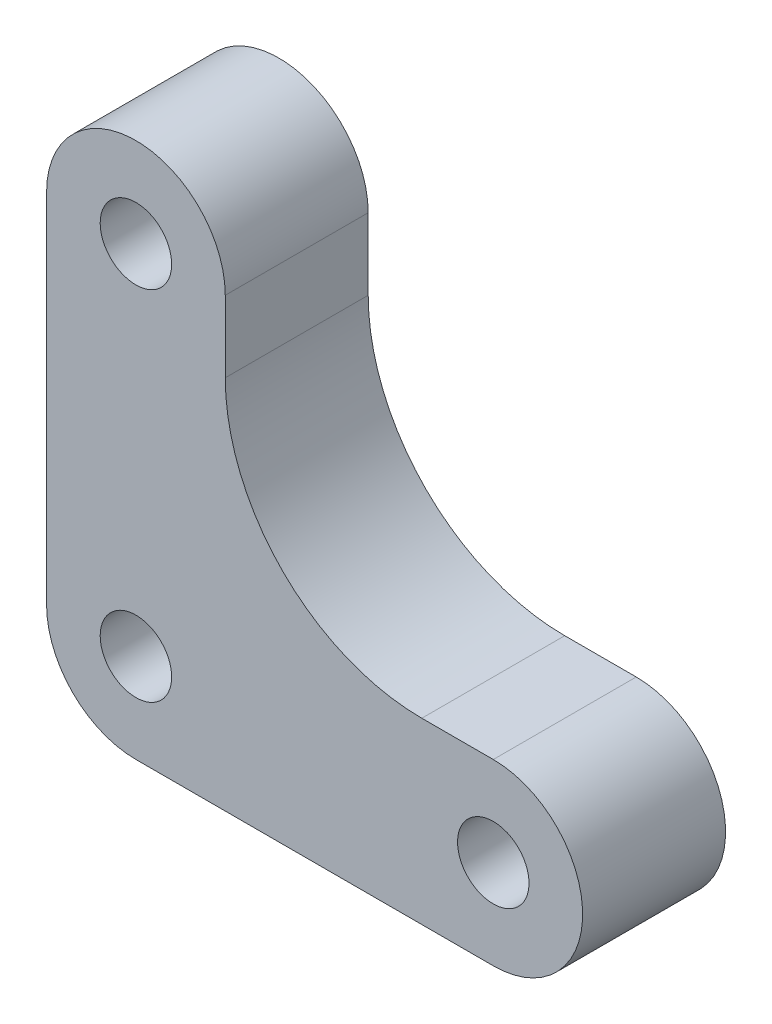
ISO-10303-21;
HEADER;
FILE_DESCRIPTION(('STEP AP214'),'2;1');
FILE_NAME('part.step','',(''),(''),'','','');
FILE_SCHEMA(('AUTOMOTIVE_DESIGN { 1 0 10303 214 1 1 1 1 }'));
ENDSEC;
DATA;
#1=APPLICATION_CONTEXT('core data for automotive mechanical design processes');
#2=APPLICATION_PROTOCOL_DEFINITION('international standard','automotive_design',2000,#1);
#3=PRODUCT_CONTEXT('',#1,'mechanical');
#4=PRODUCT('Part','Part','',(#3));
#5=PRODUCT_RELATED_PRODUCT_CATEGORY('part','',(#4));
#6=PRODUCT_DEFINITION_FORMATION('','',#4);
#7=PRODUCT_DEFINITION_CONTEXT('part definition',#1,'design');
#8=PRODUCT_DEFINITION('design','',#6,#7);
#9=PRODUCT_DEFINITION_SHAPE('','',#8);
#10=(LENGTH_UNIT() NAMED_UNIT(*) SI_UNIT(.MILLI.,.METRE.));
#11=(NAMED_UNIT(*) PLANE_ANGLE_UNIT() SI_UNIT($,.RADIAN.));
#12=(NAMED_UNIT(*) SI_UNIT($,.STERADIAN.) SOLID_ANGLE_UNIT());
#13=UNCERTAINTY_MEASURE_WITH_UNIT(LENGTH_MEASURE(1.E-05),#10,'distance_accuracy_value','');
#14=(GEOMETRIC_REPRESENTATION_CONTEXT(3) GLOBAL_UNCERTAINTY_ASSIGNED_CONTEXT((#13)) GLOBAL_UNIT_ASSIGNED_CONTEXT((#10,
#11,#12)) REPRESENTATION_CONTEXT('',''));
#15=CARTESIAN_POINT('',(0.,0.,0.));
#16=DIRECTION('',(0.,0.,1.));
#17=DIRECTION('',(1.,0.,0.));
#18=AXIS2_PLACEMENT_3D('',#15,#16,#17);
#19=CARTESIAN_POINT('',(0.,5.,-5.));
#20=DIRECTION('',(0.,1.,0.));
#21=DIRECTION('',(-1.,0.,0.));
#22=AXIS2_PLACEMENT_3D('',#19,#20,#21);
#23=PLANE('',#22);
#24=DIRECTION('',(-1.,0.,0.));
#25=VECTOR('',#24,1.);
#26=CARTESIAN_POINT('',(0.,5.,-5.));
#27=LINE('',#26,#25);
#28=CARTESIAN_POINT('',(0.,5.,-5.));
#29=VERTEX_POINT('',#28);
#30=CARTESIAN_POINT('',(-3.99999999999999,5.,-5.));
#31=VERTEX_POINT('',#30);
#32=EDGE_CURVE('E211',#29,#31,#27,.T.);
#33=ORIENTED_EDGE('',*,*,#32,.F.);
#34=DIRECTION('',(0.,0.,-1.));
#35=VECTOR('',#34,1.);
#36=CARTESIAN_POINT('',(0.,5.,-5.));
#37=LINE('',#36,#35);
#38=CARTESIAN_POINT('',(0.,5.,-13.));
#39=VERTEX_POINT('',#38);
#40=EDGE_CURVE('E239',#29,#39,#37,.T.);
#41=ORIENTED_EDGE('',*,*,#40,.T.);
#42=DIRECTION('',(-1.,0.,0.));
#43=VECTOR('',#42,1.);
#44=CARTESIAN_POINT('',(0.,5.,-13.));
#45=LINE('',#44,#43);
#46=CARTESIAN_POINT('',(-3.99999999999999,5.,-13.));
#47=VERTEX_POINT('',#46);
#48=EDGE_CURVE('E207',#39,#47,#45,.T.);
#49=ORIENTED_EDGE('',*,*,#48,.T.);
#50=DIRECTION('',(0.,0.,-1.));
#51=VECTOR('',#50,1.);
#52=CARTESIAN_POINT('',(-3.99999999999999,5.,-13.));
#53=LINE('',#52,#51);
#54=EDGE_CURVE('E278',#31,#47,#53,.T.);
#55=ORIENTED_EDGE('',*,*,#54,.F.);
#56=EDGE_LOOP('',(#33,#41,#49,#55));
#57=FACE_BOUND('',#56,.T.);
#58=ADVANCED_FACE('F43',(#57),#23,.T.);
#59=CARTESIAN_POINT('',(0.,0.,-5.));
#60=DIRECTION('',(0.,0.,-1.));
#61=DIRECTION('',(1.,0.,0.));
#62=AXIS2_PLACEMENT_3D('',#59,#60,#61);
#63=CYLINDRICAL_SURFACE('',#62,5.);
#64=CARTESIAN_POINT('',(0.,0.,-13.));
#65=DIRECTION('',(0.,0.,1.));
#66=DIRECTION('',(1.,0.,0.));
#67=AXIS2_PLACEMENT_3D('',#64,#65,#66);
#68=CIRCLE('',#67,5.);
#69=CARTESIAN_POINT('',(0.,-5.,-13.));
#70=VERTEX_POINT('',#69);
#71=EDGE_CURVE('E215',#70,#39,#68,.T.);
#72=ORIENTED_EDGE('',*,*,#71,.T.);
#73=ORIENTED_EDGE('',*,*,#40,.F.);
#74=CARTESIAN_POINT('',(0.,0.,-5.));
#75=DIRECTION('',(0.,0.,1.));
#76=DIRECTION('',(1.,0.,0.));
#77=AXIS2_PLACEMENT_3D('',#74,#75,#76);
#78=CIRCLE('',#77,5.);
#79=CARTESIAN_POINT('',(0.,-5.,-5.));
#80=VERTEX_POINT('',#79);
#81=EDGE_CURVE('E224',#80,#29,#78,.T.);
#82=ORIENTED_EDGE('',*,*,#81,.F.);
#83=DIRECTION('',(0.,0.,-1.));
#84=VECTOR('',#83,1.);
#85=CARTESIAN_POINT('',(0.,-5.,-5.));
#86=LINE('',#85,#84);
#87=EDGE_CURVE('E243',#80,#70,#86,.T.);
#88=ORIENTED_EDGE('',*,*,#87,.T.);
#89=EDGE_LOOP('',(#72,#73,#82,#88));
#90=FACE_BOUND('',#89,.T.);
#91=ADVANCED_FACE('F324',(#90),#63,.T.);
#92=CARTESIAN_POINT('',(-25.,-5.,-5.));
#93=DIRECTION('',(0.,-1.,0.));
#94=DIRECTION('',(1.,0.,0.));
#95=AXIS2_PLACEMENT_3D('',#92,#93,#94);
#96=PLANE('',#95);
#97=DIRECTION('',(1.,0.,0.));
#98=VECTOR('',#97,1.);
#99=CARTESIAN_POINT('',(-25.,-5.,-13.));
#100=LINE('',#99,#98);
#101=CARTESIAN_POINT('',(-20.,-5.,-13.));
#102=VERTEX_POINT('',#101);
#103=EDGE_CURVE('E236',#102,#70,#100,.T.);
#104=ORIENTED_EDGE('',*,*,#103,.T.);
#105=ORIENTED_EDGE('',*,*,#87,.F.);
#106=DIRECTION('',(1.,0.,0.));
#107=VECTOR('',#106,1.);
#108=CARTESIAN_POINT('',(-25.,-5.,-5.));
#109=LINE('',#108,#107);
#110=CARTESIAN_POINT('',(-20.,-5.,-5.));
#111=VERTEX_POINT('',#110);
#112=EDGE_CURVE('E222',#111,#80,#109,.T.);
#113=ORIENTED_EDGE('',*,*,#112,.F.);
#114=DIRECTION('',(0.,0.,-1.));
#115=VECTOR('',#114,1.);
#116=CARTESIAN_POINT('',(-20.,-5.,-5.));
#117=LINE('',#116,#115);
#118=EDGE_CURVE('E273',#102,#111,#117,.F.);
#119=ORIENTED_EDGE('',*,*,#118,.F.);
#120=EDGE_LOOP('',(#104,#105,#113,#119));
#121=FACE_BOUND('',#120,.T.);
#122=ADVANCED_FACE('F330',(#121),#96,.T.);
#123=CARTESIAN_POINT('',(-25.,20.,-5.));
#124=DIRECTION('',(-1.,0.,0.));
#125=DIRECTION('',(0.,-1.,0.));
#126=AXIS2_PLACEMENT_3D('',#123,#124,#125);
#127=PLANE('',#126);
#128=DIRECTION('',(0.,-1.,0.));
#129=VECTOR('',#128,1.);
#130=CARTESIAN_POINT('',(-25.,20.,-5.));
#131=LINE('',#130,#129);
#132=CARTESIAN_POINT('',(-25.,20.,-5.));
#133=VERTEX_POINT('',#132);
#134=CARTESIAN_POINT('',(-25.,0.,-5.));
#135=VERTEX_POINT('',#134);
#136=EDGE_CURVE('E219',#133,#135,#131,.T.);
#137=ORIENTED_EDGE('',*,*,#136,.F.);
#138=DIRECTION('',(0.,0.,-1.));
#139=VECTOR('',#138,1.);
#140=CARTESIAN_POINT('',(-25.,20.,-5.));
#141=LINE('',#140,#139);
#142=CARTESIAN_POINT('',(-25.,20.,-13.));
#143=VERTEX_POINT('',#142);
#144=EDGE_CURVE('E246',#133,#143,#141,.T.);
#145=ORIENTED_EDGE('',*,*,#144,.T.);
#146=DIRECTION('',(0.,-1.,0.));
#147=VECTOR('',#146,1.);
#148=CARTESIAN_POINT('',(-25.,20.,-13.));
#149=LINE('',#148,#147);
#150=CARTESIAN_POINT('',(-25.,0.,-13.));
#151=VERTEX_POINT('',#150);
#152=EDGE_CURVE('E233',#143,#151,#149,.T.);
#153=ORIENTED_EDGE('',*,*,#152,.T.);
#154=DIRECTION('',(0.,0.,-1.));
#155=VECTOR('',#154,1.);
#156=CARTESIAN_POINT('',(-25.,0.,-5.));
#157=LINE('',#156,#155);
#158=EDGE_CURVE('E268',#135,#151,#157,.T.);
#159=ORIENTED_EDGE('',*,*,#158,.F.);
#160=EDGE_LOOP('',(#137,#145,#153,#159));
#161=FACE_BOUND('',#160,.T.);
#162=ADVANCED_FACE('F374',(#161),#127,.T.);
#163=CARTESIAN_POINT('',(-20.,20.,-5.));
#164=DIRECTION('',(0.,0.,-1.));
#165=DIRECTION('',(1.,0.,0.));
#166=AXIS2_PLACEMENT_3D('',#163,#164,#165);
#167=CYLINDRICAL_SURFACE('',#166,5.);
#168=CARTESIAN_POINT('',(-20.,20.,-13.));
#169=DIRECTION('',(0.,0.,1.));
#170=DIRECTION('',(1.,0.,0.));
#171=AXIS2_PLACEMENT_3D('',#168,#169,#170);
#172=CIRCLE('',#171,5.);
#173=CARTESIAN_POINT('',(-15.,20.,-13.));
#174=VERTEX_POINT('',#173);
#175=EDGE_CURVE('E231',#174,#143,#172,.T.);
#176=ORIENTED_EDGE('',*,*,#175,.T.);
#177=ORIENTED_EDGE('',*,*,#144,.F.);
#178=CARTESIAN_POINT('',(-20.,20.,-5.));
#179=DIRECTION('',(0.,0.,1.));
#180=DIRECTION('',(1.,0.,0.));
#181=AXIS2_PLACEMENT_3D('',#178,#179,#180);
#182=CIRCLE('',#181,5.);
#183=CARTESIAN_POINT('',(-15.,20.,-5.));
#184=VERTEX_POINT('',#183);
#185=EDGE_CURVE('E217',#184,#133,#182,.T.);
#186=ORIENTED_EDGE('',*,*,#185,.F.);
#187=DIRECTION('',(0.,0.,-1.));
#188=VECTOR('',#187,1.);
#189=CARTESIAN_POINT('',(-15.,20.,-5.));
#190=LINE('',#189,#188);
#191=EDGE_CURVE('E226',#184,#174,#190,.T.);
#192=ORIENTED_EDGE('',*,*,#191,.T.);
#193=EDGE_LOOP('',(#176,#177,#186,#192));
#194=FACE_BOUND('',#193,.T.);
#195=ADVANCED_FACE('F371',(#194),#167,.T.);
#196=CARTESIAN_POINT('',(-15.,5.,-5.));
#197=DIRECTION('',(1.,0.,0.));
#198=DIRECTION('',(0.,1.,0.));
#199=AXIS2_PLACEMENT_3D('',#196,#197,#198);
#200=PLANE('',#199);
#201=DIRECTION('',(0.,1.,0.));
#202=VECTOR('',#201,1.);
#203=CARTESIAN_POINT('',(-15.,5.,-13.));
#204=LINE('',#203,#202);
#205=CARTESIAN_POINT('',(-15.,16.,-13.));
#206=VERTEX_POINT('',#205);
#207=EDGE_CURVE('E229',#206,#174,#204,.T.);
#208=ORIENTED_EDGE('',*,*,#207,.T.);
#209=ORIENTED_EDGE('',*,*,#191,.F.);
#210=DIRECTION('',(0.,1.,0.));
#211=VECTOR('',#210,1.);
#212=CARTESIAN_POINT('',(-15.,5.,-5.));
#213=LINE('',#212,#211);
#214=CARTESIAN_POINT('',(-15.,16.,-5.));
#215=VERTEX_POINT('',#214);
#216=EDGE_CURVE('E214',#215,#184,#213,.T.);
#217=ORIENTED_EDGE('',*,*,#216,.F.);
#218=DIRECTION('',(0.,0.,-1.));
#219=VECTOR('',#218,1.);
#220=CARTESIAN_POINT('',(-15.,16.,-5.));
#221=LINE('',#220,#219);
#222=EDGE_CURVE('E281',#206,#215,#221,.F.);
#223=ORIENTED_EDGE('',*,*,#222,.F.);
#224=EDGE_LOOP('',(#208,#209,#217,#223));
#225=FACE_BOUND('',#224,.T.);
#226=ADVANCED_FACE('F336',(#225),#200,.T.);
#227=CARTESIAN_POINT('',(-20.,20.,-5.));
#228=DIRECTION('',(0.,0.,-1.));
#229=DIRECTION('',(1.,0.,0.));
#230=AXIS2_PLACEMENT_3D('',#227,#228,#229);
#231=PLANE('',#230);
#232=CARTESIAN_POINT('',(-20.,20.,-5.));
#233=DIRECTION('',(0.,0.,-1.));
#234=DIRECTION('',(-1.,0.,0.));
#235=AXIS2_PLACEMENT_3D('',#232,#233,#234);
#236=CIRCLE('',#235,1.99999999999998);
#237=CARTESIAN_POINT('',(-22.,20.,-5.));
#238=VERTEX_POINT('',#237);
#239=EDGE_CURVE('E260',#238,#238,#236,.T.);
#240=ORIENTED_EDGE('',*,*,#239,.T.);
#241=EDGE_LOOP('',(#240));
#242=FACE_BOUND('',#241,.T.);
#243=CARTESIAN_POINT('',(-20.,0.,-5.));
#244=DIRECTION('',(0.,0.,-1.));
#245=DIRECTION('',(-1.,0.,0.));
#246=AXIS2_PLACEMENT_3D('',#243,#244,#245);
#247=CIRCLE('',#246,1.99999999999998);
#248=CARTESIAN_POINT('',(-22.,0.,-5.));
#249=VERTEX_POINT('',#248);
#250=EDGE_CURVE('E256',#249,#249,#247,.T.);
#251=ORIENTED_EDGE('',*,*,#250,.T.);
#252=EDGE_LOOP('',(#251));
#253=FACE_BOUND('',#252,.T.);
#254=CARTESIAN_POINT('',(0.,0.,-5.));
#255=DIRECTION('',(0.,0.,-1.));
#256=DIRECTION('',(-1.,0.,0.));
#257=AXIS2_PLACEMENT_3D('',#254,#255,#256);
#258=CIRCLE('',#257,1.99999999999999);
#259=CARTESIAN_POINT('',(-1.99999999999999,0.,-5.));
#260=VERTEX_POINT('',#259);
#261=EDGE_CURVE('E185',#260,#260,#258,.T.);
#262=ORIENTED_EDGE('',*,*,#261,.T.);
#263=EDGE_LOOP('',(#262));
#264=FACE_BOUND('',#263,.T.);
#265=ORIENTED_EDGE('',*,*,#112,.T.);
#266=ORIENTED_EDGE('',*,*,#81,.T.);
#267=ORIENTED_EDGE('',*,*,#32,.T.);
#268=CARTESIAN_POINT('',(-3.99999999999999,16.,-5.));
#269=DIRECTION('',(0.,0.,1.));
#270=DIRECTION('',(1.,0.,0.));
#271=AXIS2_PLACEMENT_3D('',#268,#269,#270);
#272=CIRCLE('',#271,11.);
#273=EDGE_CURVE('E286',#215,#31,#272,.T.);
#274=ORIENTED_EDGE('',*,*,#273,.F.);
#275=ORIENTED_EDGE('',*,*,#216,.T.);
#276=ORIENTED_EDGE('',*,*,#185,.T.);
#277=ORIENTED_EDGE('',*,*,#136,.T.);
#278=CARTESIAN_POINT('',(-20.,0.,-5.));
#279=DIRECTION('',(0.,0.,1.));
#280=DIRECTION('',(1.,0.,0.));
#281=AXIS2_PLACEMENT_3D('',#278,#279,#280);
#282=CIRCLE('',#281,5.);
#283=EDGE_CURVE('E276',#111,#135,#282,.F.);
#284=ORIENTED_EDGE('',*,*,#283,.F.);
#285=EDGE_LOOP('',(#265,#266,#267,#274,#275,#276,#277,#284));
#286=FACE_BOUND('',#285,.T.);
#287=ADVANCED_FACE('F355',(#242,#253,#264,#286),#231,.F.);
#288=CARTESIAN_POINT('',(-20.,20.,-13.));
#289=DIRECTION('',(0.,0.,-1.));
#290=DIRECTION('',(1.,0.,0.));
#291=AXIS2_PLACEMENT_3D('',#288,#289,#290);
#292=PLANE('',#291);
#293=DIRECTION('',(0.,1.,0.));
#294=VECTOR('',#293,1.);
#295=CARTESIAN_POINT('',(-17.,3.,-13.));
#296=LINE('',#295,#294);
#297=CARTESIAN_POINT('',(-17.,16.,-13.));
#298=VERTEX_POINT('',#297);
#299=CARTESIAN_POINT('',(-17.,20.,-13.));
#300=VERTEX_POINT('',#299);
#301=EDGE_CURVE('E179',#298,#300,#296,.T.);
#302=ORIENTED_EDGE('',*,*,#301,.T.);
#303=CARTESIAN_POINT('',(-20.,20.,-13.));
#304=DIRECTION('',(0.,0.,1.));
#305=DIRECTION('',(1.,0.,0.));
#306=AXIS2_PLACEMENT_3D('',#303,#304,#305);
#307=CIRCLE('',#306,3.);
#308=CARTESIAN_POINT('',(-23.,20.,-13.));
#309=VERTEX_POINT('',#308);
#310=EDGE_CURVE('E194',#300,#309,#307,.T.);
#311=ORIENTED_EDGE('',*,*,#310,.T.);
#312=DIRECTION('',(0.,-1.,0.));
#313=VECTOR('',#312,1.);
#314=CARTESIAN_POINT('',(-23.,20.,-13.));
#315=LINE('',#314,#313);
#316=CARTESIAN_POINT('',(-23.,0.,-13.));
#317=VERTEX_POINT('',#316);
#318=EDGE_CURVE('E170',#309,#317,#315,.T.);
#319=ORIENTED_EDGE('',*,*,#318,.T.);
#320=CARTESIAN_POINT('',(-20.,0.,-13.));
#321=DIRECTION('',(0.,0.,1.));
#322=DIRECTION('',(1.,0.,0.));
#323=AXIS2_PLACEMENT_3D('',#320,#321,#322);
#324=CIRCLE('',#323,3.);
#325=CARTESIAN_POINT('',(-20.,-3.,-13.));
#326=VERTEX_POINT('',#325);
#327=EDGE_CURVE('E265',#326,#317,#324,.F.);
#328=ORIENTED_EDGE('',*,*,#327,.F.);
#329=DIRECTION('',(1.,0.,0.));
#330=VECTOR('',#329,1.);
#331=CARTESIAN_POINT('',(-23.,-3.,-13.));
#332=LINE('',#331,#330);
#333=CARTESIAN_POINT('',(0.,-3.,-13.));
#334=VERTEX_POINT('',#333);
#335=EDGE_CURVE('E198',#326,#334,#332,.T.);
#336=ORIENTED_EDGE('',*,*,#335,.T.);
#337=CARTESIAN_POINT('',(0.,0.,-13.));
#338=DIRECTION('',(0.,0.,1.));
#339=DIRECTION('',(1.,0.,0.));
#340=AXIS2_PLACEMENT_3D('',#337,#338,#339);
#341=CIRCLE('',#340,3.);
#342=CARTESIAN_POINT('',(0.,3.,-13.));
#343=VERTEX_POINT('',#342);
#344=EDGE_CURVE('E201',#334,#343,#341,.T.);
#345=ORIENTED_EDGE('',*,*,#344,.T.);
#346=DIRECTION('',(-1.,0.,0.));
#347=VECTOR('',#346,1.);
#348=CARTESIAN_POINT('',(0.,3.,-13.));
#349=LINE('',#348,#347);
#350=CARTESIAN_POINT('',(-4.,3.,-13.));
#351=VERTEX_POINT('',#350);
#352=EDGE_CURVE('E182',#343,#351,#349,.T.);
#353=ORIENTED_EDGE('',*,*,#352,.T.);
#354=CARTESIAN_POINT('',(-4.,16.,-13.));
#355=DIRECTION('',(0.,0.,1.));
#356=DIRECTION('',(1.,0.,0.));
#357=AXIS2_PLACEMENT_3D('',#354,#355,#356);
#358=CIRCLE('',#357,13.);
#359=EDGE_CURVE('E290',#298,#351,#358,.T.);
#360=ORIENTED_EDGE('',*,*,#359,.F.);
#361=EDGE_LOOP('',(#302,#311,#319,#328,#336,#345,#353,#360));
#362=FACE_BOUND('',#361,.T.);
#363=ORIENTED_EDGE('',*,*,#152,.F.);
#364=ORIENTED_EDGE('',*,*,#175,.F.);
#365=ORIENTED_EDGE('',*,*,#207,.F.);
#366=CARTESIAN_POINT('',(-3.99999999999999,16.,-13.));
#367=DIRECTION('',(0.,0.,1.));
#368=DIRECTION('',(1.,0.,0.));
#369=AXIS2_PLACEMENT_3D('',#366,#367,#368);
#370=CIRCLE('',#369,11.);
#371=EDGE_CURVE('E284',#47,#206,#370,.F.);
#372=ORIENTED_EDGE('',*,*,#371,.F.);
#373=ORIENTED_EDGE('',*,*,#48,.F.);
#374=ORIENTED_EDGE('',*,*,#71,.F.);
#375=ORIENTED_EDGE('',*,*,#103,.F.);
#376=CARTESIAN_POINT('',(-20.,0.,-13.));
#377=DIRECTION('',(0.,0.,1.));
#378=DIRECTION('',(1.,0.,0.));
#379=AXIS2_PLACEMENT_3D('',#376,#377,#378);
#380=CIRCLE('',#379,5.);
#381=EDGE_CURVE('E271',#151,#102,#380,.T.);
#382=ORIENTED_EDGE('',*,*,#381,.F.);
#383=EDGE_LOOP('',(#363,#364,#365,#372,#373,#374,#375,#382));
#384=FACE_BOUND('',#383,.T.);
#385=ADVANCED_FACE('F309',(#362,#384),#292,.T.);
#386=CARTESIAN_POINT('',(-20.,20.,-10.));
#387=DIRECTION('',(0.,0.,-1.));
#388=DIRECTION('',(1.,0.,0.));
#389=AXIS2_PLACEMENT_3D('',#386,#387,#388);
#390=CYLINDRICAL_SURFACE('',#389,3.);
#391=ORIENTED_EDGE('',*,*,#310,.F.);
#392=DIRECTION('',(0.,0.,-1.));
#393=VECTOR('',#392,1.);
#394=CARTESIAN_POINT('',(-17.,20.,-10.));
#395=LINE('',#394,#393);
#396=CARTESIAN_POINT('',(-17.,20.,-10.));
#397=VERTEX_POINT('',#396);
#398=EDGE_CURVE('E178',#397,#300,#395,.T.);
#399=ORIENTED_EDGE('',*,*,#398,.F.);
#400=CARTESIAN_POINT('',(-20.,20.,-10.));
#401=DIRECTION('',(0.,0.,1.));
#402=DIRECTION('',(1.,0.,0.));
#403=AXIS2_PLACEMENT_3D('',#400,#401,#402);
#404=CIRCLE('',#403,3.);
#405=CARTESIAN_POINT('',(-23.,20.,-10.));
#406=VERTEX_POINT('',#405);
#407=EDGE_CURVE('E158',#397,#406,#404,.T.);
#408=ORIENTED_EDGE('',*,*,#407,.T.);
#409=DIRECTION('',(0.,0.,-1.));
#410=VECTOR('',#409,1.);
#411=CARTESIAN_POINT('',(-23.,20.,-10.));
#412=LINE('',#411,#410);
#413=EDGE_CURVE('E167',#406,#309,#412,.T.);
#414=ORIENTED_EDGE('',*,*,#413,.T.);
#415=EDGE_LOOP('',(#391,#399,#408,#414));
#416=FACE_BOUND('',#415,.T.);
#417=ADVANCED_FACE('F177',(#416),#390,.F.);
#418=CARTESIAN_POINT('',(-17.,3.,-10.));
#419=DIRECTION('',(1.,0.,0.));
#420=DIRECTION('',(0.,0.,1.));
#421=AXIS2_PLACEMENT_3D('',#418,#419,#420);
#422=PLANE('',#421);
#423=DIRECTION('',(0.,1.,0.));
#424=VECTOR('',#423,1.);
#425=CARTESIAN_POINT('',(-17.,3.,-10.));
#426=LINE('',#425,#424);
#427=CARTESIAN_POINT('',(-17.,16.,-10.));
#428=VERTEX_POINT('',#427);
#429=EDGE_CURVE('E175',#428,#397,#426,.T.);
#430=ORIENTED_EDGE('',*,*,#429,.T.);
#431=ORIENTED_EDGE('',*,*,#398,.T.);
#432=ORIENTED_EDGE('',*,*,#301,.F.);
#433=DIRECTION('',(0.,0.,-1.));
#434=VECTOR('',#433,1.);
#435=CARTESIAN_POINT('',(-17.,16.,-10.));
#436=LINE('',#435,#434);
#437=EDGE_CURVE('E288',#428,#298,#436,.T.);
#438=ORIENTED_EDGE('',*,*,#437,.F.);
#439=EDGE_LOOP('',(#430,#431,#432,#438));
#440=FACE_BOUND('',#439,.T.);
#441=ADVANCED_FACE('F313',(#440),#422,.F.);
#442=CARTESIAN_POINT('',(0.,3.,-10.));
#443=DIRECTION('',(0.,1.,0.));
#444=DIRECTION('',(-1.,0.,0.));
#445=AXIS2_PLACEMENT_3D('',#442,#443,#444);
#446=PLANE('',#445);
#447=ORIENTED_EDGE('',*,*,#352,.F.);
#448=DIRECTION('',(0.,0.,-1.));
#449=VECTOR('',#448,1.);
#450=CARTESIAN_POINT('',(0.,3.,-10.));
#451=LINE('',#450,#449);
#452=CARTESIAN_POINT('',(0.,3.,-10.));
#453=VERTEX_POINT('',#452);
#454=EDGE_CURVE('E208',#453,#343,#451,.T.);
#455=ORIENTED_EDGE('',*,*,#454,.F.);
#456=DIRECTION('',(-1.,0.,0.));
#457=VECTOR('',#456,1.);
#458=CARTESIAN_POINT('',(0.,3.,-10.));
#459=LINE('',#458,#457);
#460=CARTESIAN_POINT('',(-4.,3.,-10.));
#461=VERTEX_POINT('',#460);
#462=EDGE_CURVE('E191',#453,#461,#459,.T.);
#463=ORIENTED_EDGE('',*,*,#462,.T.);
#464=DIRECTION('',(0.,0.,-1.));
#465=VECTOR('',#464,1.);
#466=CARTESIAN_POINT('',(-4.,3.,-10.));
#467=LINE('',#466,#465);
#468=EDGE_CURVE('E51',#351,#461,#467,.F.);
#469=ORIENTED_EDGE('',*,*,#468,.F.);
#470=EDGE_LOOP('',(#447,#455,#463,#469));
#471=FACE_BOUND('',#470,.T.);
#472=ADVANCED_FACE('F295',(#471),#446,.F.);
#473=CARTESIAN_POINT('',(0.,0.,-10.));
#474=DIRECTION('',(0.,0.,-1.));
#475=DIRECTION('',(1.,0.,0.));
#476=AXIS2_PLACEMENT_3D('',#473,#474,#475);
#477=CYLINDRICAL_SURFACE('',#476,3.);
#478=ORIENTED_EDGE('',*,*,#344,.F.);
#479=DIRECTION('',(0.,0.,-1.));
#480=VECTOR('',#479,1.);
#481=CARTESIAN_POINT('',(0.,-3.,-10.));
#482=LINE('',#481,#480);
#483=CARTESIAN_POINT('',(0.,-3.,-10.));
#484=VERTEX_POINT('',#483);
#485=EDGE_CURVE('E174',#484,#334,#482,.T.);
#486=ORIENTED_EDGE('',*,*,#485,.F.);
#487=CARTESIAN_POINT('',(0.,0.,-10.));
#488=DIRECTION('',(0.,0.,1.));
#489=DIRECTION('',(1.,0.,0.));
#490=AXIS2_PLACEMENT_3D('',#487,#488,#489);
#491=CIRCLE('',#490,3.);
#492=EDGE_CURVE('E189',#484,#453,#491,.T.);
#493=ORIENTED_EDGE('',*,*,#492,.T.);
#494=ORIENTED_EDGE('',*,*,#454,.T.);
#495=EDGE_LOOP('',(#478,#486,#493,#494));
#496=FACE_BOUND('',#495,.T.);
#497=ADVANCED_FACE('F300',(#496),#477,.F.);
#498=CARTESIAN_POINT('',(-23.,-3.,-10.));
#499=DIRECTION('',(0.,-1.,0.));
#500=DIRECTION('',(0.,0.,1.));
#501=AXIS2_PLACEMENT_3D('',#498,#499,#500);
#502=PLANE('',#501);
#503=DIRECTION('',(1.,0.,0.));
#504=VECTOR('',#503,1.);
#505=CARTESIAN_POINT('',(-23.,-3.,-10.));
#506=LINE('',#505,#504);
#507=CARTESIAN_POINT('',(-20.,-3.,-10.));
#508=VERTEX_POINT('',#507);
#509=EDGE_CURVE('E164',#508,#484,#506,.T.);
#510=ORIENTED_EDGE('',*,*,#509,.T.);
#511=ORIENTED_EDGE('',*,*,#485,.T.);
#512=ORIENTED_EDGE('',*,*,#335,.F.);
#513=DIRECTION('',(0.,0.,-1.));
#514=VECTOR('',#513,1.);
#515=CARTESIAN_POINT('',(-20.,-3.,-13.));
#516=LINE('',#515,#514);
#517=EDGE_CURVE('E242',#508,#326,#516,.T.);
#518=ORIENTED_EDGE('',*,*,#517,.F.);
#519=EDGE_LOOP('',(#510,#511,#512,#518));
#520=FACE_BOUND('',#519,.T.);
#521=ADVANCED_FACE('F303',(#520),#502,.F.);
#522=CARTESIAN_POINT('',(-23.,20.,-10.));
#523=DIRECTION('',(-1.,0.,0.));
#524=DIRECTION('',(0.,0.,-1.));
#525=AXIS2_PLACEMENT_3D('',#522,#523,#524);
#526=PLANE('',#525);
#527=ORIENTED_EDGE('',*,*,#318,.F.);
#528=ORIENTED_EDGE('',*,*,#413,.F.);
#529=DIRECTION('',(0.,-1.,0.));
#530=VECTOR('',#529,1.);
#531=CARTESIAN_POINT('',(-23.,20.,-10.));
#532=LINE('',#531,#530);
#533=CARTESIAN_POINT('',(-23.,0.,-10.));
#534=VERTEX_POINT('',#533);
#535=EDGE_CURVE('E154',#406,#534,#532,.T.);
#536=ORIENTED_EDGE('',*,*,#535,.T.);
#537=DIRECTION('',(0.,0.,-1.));
#538=VECTOR('',#537,1.);
#539=CARTESIAN_POINT('',(-23.,0.,-10.));
#540=LINE('',#539,#538);
#541=EDGE_CURVE('E262',#317,#534,#540,.F.);
#542=ORIENTED_EDGE('',*,*,#541,.F.);
#543=EDGE_LOOP('',(#527,#528,#536,#542));
#544=FACE_BOUND('',#543,.T.);
#545=ADVANCED_FACE('F168',(#544),#526,.F.);
#546=CARTESIAN_POINT('',(-20.,20.,-10.));
#547=DIRECTION('',(0.,0.,-1.));
#548=DIRECTION('',(1.,0.,0.));
#549=AXIS2_PLACEMENT_3D('',#546,#547,#548);
#550=PLANE('',#549);
#551=CARTESIAN_POINT('',(-20.,20.,-10.));
#552=DIRECTION('',(0.,0.,1.));
#553=DIRECTION('',(1.,0.,0.));
#554=AXIS2_PLACEMENT_3D('',#551,#552,#553);
#555=CIRCLE('',#554,1.99999999999998);
#556=CARTESIAN_POINT('',(-18.,20.,-10.));
#557=VERTEX_POINT('',#556);
#558=EDGE_CURVE('E257',#557,#557,#555,.T.);
#559=ORIENTED_EDGE('',*,*,#558,.T.);
#560=EDGE_LOOP('',(#559));
#561=FACE_BOUND('',#560,.T.);
#562=CARTESIAN_POINT('',(-20.,0.,-10.));
#563=DIRECTION('',(0.,0.,1.));
#564=DIRECTION('',(1.,0.,0.));
#565=AXIS2_PLACEMENT_3D('',#562,#563,#564);
#566=CIRCLE('',#565,1.99999999999998);
#567=CARTESIAN_POINT('',(-18.,0.,-10.));
#568=VERTEX_POINT('',#567);
#569=EDGE_CURVE('E253',#568,#568,#566,.T.);
#570=ORIENTED_EDGE('',*,*,#569,.T.);
#571=EDGE_LOOP('',(#570));
#572=FACE_BOUND('',#571,.T.);
#573=CARTESIAN_POINT('',(0.,0.,-10.));
#574=DIRECTION('',(0.,0.,1.));
#575=DIRECTION('',(1.,0.,0.));
#576=AXIS2_PLACEMENT_3D('',#573,#574,#575);
#577=CIRCLE('',#576,1.99999999999999);
#578=CARTESIAN_POINT('',(1.99999999999999,0.,-10.));
#579=VERTEX_POINT('',#578);
#580=EDGE_CURVE('E196',#579,#579,#577,.T.);
#581=ORIENTED_EDGE('',*,*,#580,.T.);
#582=EDGE_LOOP('',(#581));
#583=FACE_BOUND('',#582,.T.);
#584=ORIENTED_EDGE('',*,*,#535,.F.);
#585=ORIENTED_EDGE('',*,*,#407,.F.);
#586=ORIENTED_EDGE('',*,*,#429,.F.);
#587=CARTESIAN_POINT('',(-4.,16.,-10.));
#588=DIRECTION('',(0.,0.,1.));
#589=DIRECTION('',(1.,0.,0.));
#590=AXIS2_PLACEMENT_3D('',#587,#588,#589);
#591=CIRCLE('',#590,13.);
#592=EDGE_CURVE('E11',#461,#428,#591,.F.);
#593=ORIENTED_EDGE('',*,*,#592,.F.);
#594=ORIENTED_EDGE('',*,*,#462,.F.);
#595=ORIENTED_EDGE('',*,*,#492,.F.);
#596=ORIENTED_EDGE('',*,*,#509,.F.);
#597=CARTESIAN_POINT('',(-20.,0.,-10.));
#598=DIRECTION('',(0.,0.,1.));
#599=DIRECTION('',(1.,0.,0.));
#600=AXIS2_PLACEMENT_3D('',#597,#598,#599);
#601=CIRCLE('',#600,3.);
#602=EDGE_CURVE('E161',#534,#508,#601,.T.);
#603=ORIENTED_EDGE('',*,*,#602,.F.);
#604=EDGE_LOOP('',(#584,#585,#586,#593,#594,#595,#596,#603));
#605=FACE_BOUND('',#604,.T.);
#606=ADVANCED_FACE('F156',(#561,#572,#583,#605),#550,.T.);
#607=CARTESIAN_POINT('',(0.,0.,-5.));
#608=DIRECTION('',(0.,0.,1.));
#609=DIRECTION('',(-1.,0.,0.));
#610=AXIS2_PLACEMENT_3D('',#607,#608,#609);
#611=CYLINDRICAL_SURFACE('',#610,1.99999999999999);
#612=ORIENTED_EDGE('',*,*,#580,.F.);
#613=EDGE_LOOP('',(#612));
#614=FACE_BOUND('',#613,.T.);
#615=ORIENTED_EDGE('',*,*,#261,.F.);
#616=EDGE_LOOP('',(#615));
#617=FACE_BOUND('',#616,.T.);
#618=ADVANCED_FACE('F425',(#614,#617),#611,.F.);
#619=CARTESIAN_POINT('',(-20.,0.,-5.));
#620=DIRECTION('',(0.,0.,1.));
#621=DIRECTION('',(-1.,0.,0.));
#622=AXIS2_PLACEMENT_3D('',#619,#620,#621);
#623=CYLINDRICAL_SURFACE('',#622,1.99999999999998);
#624=ORIENTED_EDGE('',*,*,#569,.F.);
#625=EDGE_LOOP('',(#624));
#626=FACE_BOUND('',#625,.T.);
#627=ORIENTED_EDGE('',*,*,#250,.F.);
#628=EDGE_LOOP('',(#627));
#629=FACE_BOUND('',#628,.T.);
#630=ADVANCED_FACE('F433',(#626,#629),#623,.F.);
#631=CARTESIAN_POINT('',(-20.,20.,-5.));
#632=DIRECTION('',(0.,0.,1.));
#633=DIRECTION('',(-1.,0.,0.));
#634=AXIS2_PLACEMENT_3D('',#631,#632,#633);
#635=CYLINDRICAL_SURFACE('',#634,1.99999999999998);
#636=ORIENTED_EDGE('',*,*,#558,.F.);
#637=EDGE_LOOP('',(#636));
#638=FACE_BOUND('',#637,.T.);
#639=ORIENTED_EDGE('',*,*,#239,.F.);
#640=EDGE_LOOP('',(#639));
#641=FACE_BOUND('',#640,.T.);
#642=ADVANCED_FACE('F341',(#638,#641),#635,.F.);
#643=CARTESIAN_POINT('',(-20.,0.,-10.));
#644=DIRECTION('',(0.,0.,1.));
#645=DIRECTION('',(-1.,0.,0.));
#646=AXIS2_PLACEMENT_3D('',#643,#644,#645);
#647=CYLINDRICAL_SURFACE('',#646,3.);
#648=ORIENTED_EDGE('',*,*,#602,.T.);
#649=ORIENTED_EDGE('',*,*,#517,.T.);
#650=ORIENTED_EDGE('',*,*,#327,.T.);
#651=ORIENTED_EDGE('',*,*,#541,.T.);
#652=EDGE_LOOP('',(#648,#649,#650,#651));
#653=FACE_BOUND('',#652,.T.);
#654=ADVANCED_FACE('F307',(#653),#647,.F.);
#655=CARTESIAN_POINT('',(-20.,0.,-5.));
#656=DIRECTION('',(0.,0.,-1.));
#657=DIRECTION('',(1.,0.,0.));
#658=AXIS2_PLACEMENT_3D('',#655,#656,#657);
#659=CYLINDRICAL_SURFACE('',#658,5.);
#660=ORIENTED_EDGE('',*,*,#283,.T.);
#661=ORIENTED_EDGE('',*,*,#158,.T.);
#662=ORIENTED_EDGE('',*,*,#381,.T.);
#663=ORIENTED_EDGE('',*,*,#118,.T.);
#664=EDGE_LOOP('',(#660,#661,#662,#663));
#665=FACE_BOUND('',#664,.T.);
#666=ADVANCED_FACE('F340',(#665),#659,.T.);
#667=CARTESIAN_POINT('',(-3.99999999999999,16.,-5.));
#668=DIRECTION('',(0.,0.,1.));
#669=DIRECTION('',(-1.,0.,0.));
#670=AXIS2_PLACEMENT_3D('',#667,#668,#669);
#671=CYLINDRICAL_SURFACE('',#670,11.);
#672=ORIENTED_EDGE('',*,*,#273,.T.);
#673=ORIENTED_EDGE('',*,*,#54,.T.);
#674=ORIENTED_EDGE('',*,*,#371,.T.);
#675=ORIENTED_EDGE('',*,*,#222,.T.);
#676=EDGE_LOOP('',(#672,#673,#674,#675));
#677=FACE_BOUND('',#676,.T.);
#678=ADVANCED_FACE('F343',(#677),#671,.F.);
#679=CARTESIAN_POINT('',(-4.,16.,-10.));
#680=DIRECTION('',(0.,0.,-1.));
#681=DIRECTION('',(1.,0.,0.));
#682=AXIS2_PLACEMENT_3D('',#679,#680,#681);
#683=CYLINDRICAL_SURFACE('',#682,13.);
#684=ORIENTED_EDGE('',*,*,#592,.T.);
#685=ORIENTED_EDGE('',*,*,#437,.T.);
#686=ORIENTED_EDGE('',*,*,#359,.T.);
#687=ORIENTED_EDGE('',*,*,#468,.T.);
#688=EDGE_LOOP('',(#684,#685,#686,#687));
#689=FACE_BOUND('',#688,.T.);
#690=ADVANCED_FACE('F45',(#689),#683,.T.);
#691=CLOSED_SHELL('',(#58,#91,#122,#162,#195,#226,#287,#385,#417,#441,#472,#497,#521,#545,#606,
#618,#630,#642,#654,#666,#678,#690));
#692=MANIFOLD_SOLID_BREP('B2',#691);
#693=ADVANCED_BREP_SHAPE_REPRESENTATION('',(#18,#692),#14);
#694=SHAPE_DEFINITION_REPRESENTATION(#9,#693);
ENDSEC;
END-ISO-10303-21;
